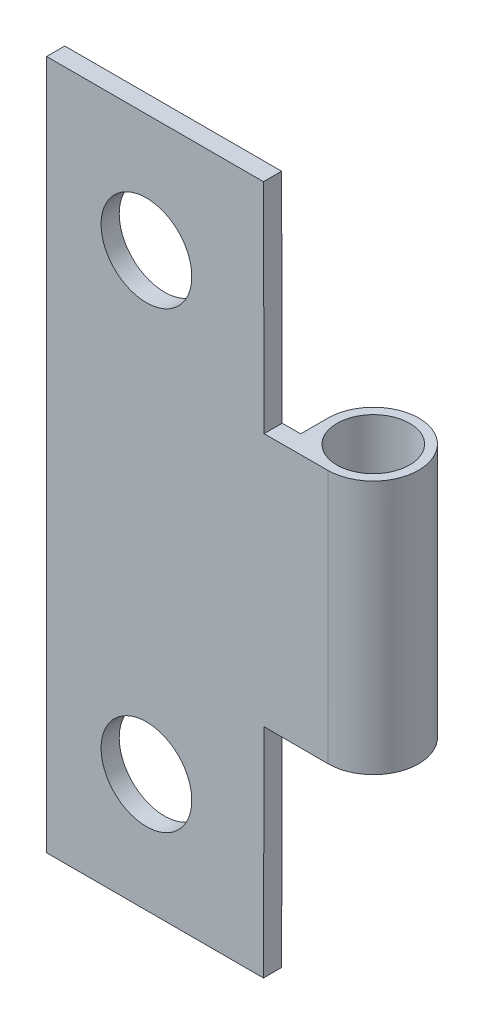
ISO-10303-21;
HEADER;
FILE_DESCRIPTION(('STEP AP214'),'2;1');
FILE_NAME('part.step','',(''),(''),'','','');
FILE_SCHEMA(('AUTOMOTIVE_DESIGN { 1 0 10303 214 1 1 1 1 }'));
ENDSEC;
DATA;
#1=APPLICATION_CONTEXT('core data for automotive mechanical design processes');
#2=APPLICATION_PROTOCOL_DEFINITION('international standard','automotive_design',2000,#1);
#3=PRODUCT_CONTEXT('',#1,'mechanical');
#4=PRODUCT('Part','Part','',(#3));
#5=PRODUCT_RELATED_PRODUCT_CATEGORY('part','',(#4));
#6=PRODUCT_DEFINITION_FORMATION('','',#4);
#7=PRODUCT_DEFINITION_CONTEXT('part definition',#1,'design');
#8=PRODUCT_DEFINITION('design','',#6,#7);
#9=PRODUCT_DEFINITION_SHAPE('','',#8);
#10=(LENGTH_UNIT() NAMED_UNIT(*) SI_UNIT(.MILLI.,.METRE.));
#11=(NAMED_UNIT(*) PLANE_ANGLE_UNIT() SI_UNIT($,.RADIAN.));
#12=(NAMED_UNIT(*) SI_UNIT($,.STERADIAN.) SOLID_ANGLE_UNIT());
#13=UNCERTAINTY_MEASURE_WITH_UNIT(LENGTH_MEASURE(1.E-05),#10,'distance_accuracy_value','');
#14=(GEOMETRIC_REPRESENTATION_CONTEXT(3) GLOBAL_UNCERTAINTY_ASSIGNED_CONTEXT((#13)) GLOBAL_UNIT_ASSIGNED_CONTEXT((#10,
#11,#12)) REPRESENTATION_CONTEXT('',''));
#15=CARTESIAN_POINT('',(0.,0.,0.));
#16=DIRECTION('',(0.,0.,1.));
#17=DIRECTION('',(1.,0.,0.));
#18=AXIS2_PLACEMENT_3D('',#15,#16,#17);
#19=CARTESIAN_POINT('',(-6.5,-19.,1.));
#20=DIRECTION('',(1.,0.,0.));
#21=DIRECTION('',(0.,1.,0.));
#22=AXIS2_PLACEMENT_3D('',#19,#20,#21);
#23=PLANE('',#22);
#24=DIRECTION('',(0.,-1.,0.));
#25=VECTOR('',#24,1.);
#26=CARTESIAN_POINT('',(-6.5,-19.,0.));
#27=LINE('',#26,#25);
#28=CARTESIAN_POINT('',(-6.50000000000001,19.,0.));
#29=VERTEX_POINT('',#28);
#30=CARTESIAN_POINT('',(-6.5,-19.,0.));
#31=VERTEX_POINT('',#30);
#32=EDGE_CURVE('E155',#29,#31,#27,.T.);
#33=ORIENTED_EDGE('',*,*,#32,.T.);
#34=DIRECTION('',(0.,0.,-1.));
#35=VECTOR('',#34,1.);
#36=CARTESIAN_POINT('',(-6.5,-19.,1.));
#37=LINE('',#36,#35);
#38=CARTESIAN_POINT('',(-6.5,-19.,1.));
#39=VERTEX_POINT('',#38);
#40=EDGE_CURVE('E174',#39,#31,#37,.T.);
#41=ORIENTED_EDGE('',*,*,#40,.F.);
#42=DIRECTION('',(0.,-1.,0.));
#43=VECTOR('',#42,1.);
#44=CARTESIAN_POINT('',(-6.5,-19.,1.));
#45=LINE('',#44,#43);
#46=CARTESIAN_POINT('',(-6.50000000000001,19.,1.));
#47=VERTEX_POINT('',#46);
#48=EDGE_CURVE('E157',#47,#39,#45,.T.);
#49=ORIENTED_EDGE('',*,*,#48,.F.);
#50=DIRECTION('',(0.,0.,-1.));
#51=VECTOR('',#50,1.);
#52=CARTESIAN_POINT('',(-6.50000000000001,19.,1.));
#53=LINE('',#52,#51);
#54=EDGE_CURVE('E163',#47,#29,#53,.T.);
#55=ORIENTED_EDGE('',*,*,#54,.T.);
#56=EDGE_LOOP('',(#33,#41,#49,#55));
#57=FACE_BOUND('',#56,.T.);
#58=ADVANCED_FACE('F32',(#57),#23,.F.);
#59=CARTESIAN_POINT('',(-6.5,-19.,1.));
#60=DIRECTION('',(0.,1.,0.));
#61=DIRECTION('',(0.,0.,1.));
#62=AXIS2_PLACEMENT_3D('',#59,#60,#61);
#63=PLANE('',#62);
#64=DIRECTION('',(1.,0.,0.));
#65=VECTOR('',#64,1.);
#66=CARTESIAN_POINT('',(-6.5,-19.,0.));
#67=LINE('',#66,#65);
#68=CARTESIAN_POINT('',(5.44826372232161,-19.,0.));
#69=VERTEX_POINT('',#68);
#70=EDGE_CURVE('E166',#31,#69,#67,.T.);
#71=ORIENTED_EDGE('',*,*,#70,.T.);
#72=DIRECTION('',(0.,0.,1.));
#73=VECTOR('',#72,1.);
#74=CARTESIAN_POINT('',(5.44826372232161,-19.,1.));
#75=LINE('',#74,#73);
#76=CARTESIAN_POINT('',(5.44826372232161,-19.,1.));
#77=VERTEX_POINT('',#76);
#78=EDGE_CURVE('E132',#69,#77,#75,.T.);
#79=ORIENTED_EDGE('',*,*,#78,.T.);
#80=DIRECTION('',(1.,0.,0.));
#81=VECTOR('',#80,1.);
#82=CARTESIAN_POINT('',(-6.5,-19.,1.));
#83=LINE('',#82,#81);
#84=EDGE_CURVE('E120',#39,#77,#83,.T.);
#85=ORIENTED_EDGE('',*,*,#84,.F.);
#86=ORIENTED_EDGE('',*,*,#40,.T.);
#87=EDGE_LOOP('',(#71,#79,#85,#86));
#88=FACE_BOUND('',#87,.T.);
#89=ADVANCED_FACE('F197',(#88),#63,.F.);
#90=CARTESIAN_POINT('',(-6.50000000000001,19.,1.));
#91=DIRECTION('',(0.,-1.,0.));
#92=DIRECTION('',(0.,0.,-1.));
#93=AXIS2_PLACEMENT_3D('',#90,#91,#92);
#94=PLANE('',#93);
#95=DIRECTION('',(-1.,0.,0.));
#96=VECTOR('',#95,1.);
#97=CARTESIAN_POINT('',(-6.50000000000001,19.,1.));
#98=LINE('',#97,#96);
#99=CARTESIAN_POINT('',(5.44826372232158,19.,1.));
#100=VERTEX_POINT('',#99);
#101=EDGE_CURVE('E161',#100,#47,#98,.T.);
#102=ORIENTED_EDGE('',*,*,#101,.F.);
#103=DIRECTION('',(0.,0.,-1.));
#104=VECTOR('',#103,1.);
#105=CARTESIAN_POINT('',(5.44826372232158,19.,1.));
#106=LINE('',#105,#104);
#107=CARTESIAN_POINT('',(5.44826372232158,19.,0.));
#108=VERTEX_POINT('',#107);
#109=EDGE_CURVE('E150',#100,#108,#106,.T.);
#110=ORIENTED_EDGE('',*,*,#109,.T.);
#111=DIRECTION('',(-1.,0.,0.));
#112=VECTOR('',#111,1.);
#113=CARTESIAN_POINT('',(-6.50000000000001,19.,0.));
#114=LINE('',#113,#112);
#115=EDGE_CURVE('E159',#108,#29,#114,.T.);
#116=ORIENTED_EDGE('',*,*,#115,.T.);
#117=ORIENTED_EDGE('',*,*,#54,.F.);
#118=EDGE_LOOP('',(#102,#110,#116,#117));
#119=FACE_BOUND('',#118,.T.);
#120=ADVANCED_FACE('F202',(#119),#94,.F.);
#121=CARTESIAN_POINT('',(0.,0.,1.));
#122=DIRECTION('',(0.,0.,-1.));
#123=DIRECTION('',(-1.,0.,0.));
#124=AXIS2_PLACEMENT_3D('',#121,#122,#123);
#125=PLANE('',#124);
#126=CARTESIAN_POINT('',(-1.00000000000001,-12.5,1.));
#127=DIRECTION('',(0.,0.,-1.));
#128=DIRECTION('',(-1.,0.,0.));
#129=AXIS2_PLACEMENT_3D('',#126,#127,#128);
#130=CIRCLE('',#129,2.5);
#131=CARTESIAN_POINT('',(-3.50000000000001,-12.5,1.));
#132=VERTEX_POINT('',#131);
#133=EDGE_CURVE('E322',#132,#132,#130,.T.);
#134=ORIENTED_EDGE('',*,*,#133,.T.);
#135=EDGE_LOOP('',(#134));
#136=FACE_BOUND('',#135,.T.);
#137=CARTESIAN_POINT('',(-1.,12.5,1.));
#138=DIRECTION('',(0.,0.,-1.));
#139=DIRECTION('',(-1.,0.,0.));
#140=AXIS2_PLACEMENT_3D('',#137,#138,#139);
#141=CIRCLE('',#140,2.5);
#142=CARTESIAN_POINT('',(-3.5,12.5,1.));
#143=VERTEX_POINT('',#142);
#144=EDGE_CURVE('E121',#143,#143,#141,.T.);
#145=ORIENTED_EDGE('',*,*,#144,.T.);
#146=EDGE_LOOP('',(#145));
#147=FACE_BOUND('',#146,.T.);
#148=ORIENTED_EDGE('',*,*,#84,.T.);
#149=DIRECTION('',(-0.00272226932309057,-0.999996294618001,0.));
#150=VECTOR('',#149,1.);
#151=CARTESIAN_POINT('',(5.48095708357535,-6.9904461196952,1.));
#152=LINE('',#151,#150);
#153=CARTESIAN_POINT('',(5.48095708357535,-6.9904461196952,1.));
#154=VERTEX_POINT('',#153);
#155=EDGE_CURVE('E106',#154,#77,#152,.T.);
#156=ORIENTED_EDGE('',*,*,#155,.F.);
#157=DIRECTION('',(-0.999996294618001,0.002722269323091,0.));
#158=VECTOR('',#157,1.);
#159=CARTESIAN_POINT('',(5.48095708357535,-6.9904461196952,1.));
#160=LINE('',#159,#158);
#161=CARTESIAN_POINT('',(9.,-7.00002593777011,1.));
#162=VERTEX_POINT('',#161);
#163=EDGE_CURVE('E111',#162,#154,#160,.T.);
#164=ORIENTED_EDGE('',*,*,#163,.F.);
#165=DIRECTION('',(0.,1.,0.));
#166=VECTOR('',#165,1.);
#167=CARTESIAN_POINT('',(9.,-19.,1.));
#168=LINE('',#167,#166);
#169=CARTESIAN_POINT('',(9.,7.00002593777009,1.));
#170=VERTEX_POINT('',#169);
#171=EDGE_CURVE('E54',#162,#170,#168,.T.);
#172=ORIENTED_EDGE('',*,*,#171,.T.);
#173=DIRECTION('',(0.999996294618001,0.00272226932309199,0.));
#174=VECTOR('',#173,1.);
#175=CARTESIAN_POINT('',(5.48095708357535,6.99044611969518,1.));
#176=LINE('',#175,#174);
#177=CARTESIAN_POINT('',(5.48095708357535,6.99044611969518,1.));
#178=VERTEX_POINT('',#177);
#179=EDGE_CURVE('E136',#178,#170,#176,.T.);
#180=ORIENTED_EDGE('',*,*,#179,.F.);
#181=DIRECTION('',(0.00272226932309168,-0.999996294618001,0.));
#182=VECTOR('',#181,1.);
#183=CARTESIAN_POINT('',(5.48095708357535,6.99044611969518,1.));
#184=LINE('',#183,#182);
#185=EDGE_CURVE('E134',#100,#178,#184,.T.);
#186=ORIENTED_EDGE('',*,*,#185,.F.);
#187=ORIENTED_EDGE('',*,*,#101,.T.);
#188=ORIENTED_EDGE('',*,*,#48,.T.);
#189=EDGE_LOOP('',(#148,#156,#164,#172,#180,#186,#187,#188));
#190=FACE_BOUND('',#189,.T.);
#191=ADVANCED_FACE('F118',(#136,#147,#190),#125,.F.);
#192=CARTESIAN_POINT('',(0.,0.,0.));
#193=DIRECTION('',(0.,0.,-1.));
#194=DIRECTION('',(-1.,0.,0.));
#195=AXIS2_PLACEMENT_3D('',#192,#193,#194);
#196=PLANE('',#195);
#197=CARTESIAN_POINT('',(-1.00000000000001,-12.5,0.));
#198=DIRECTION('',(0.,0.,-1.));
#199=DIRECTION('',(-1.,0.,0.));
#200=AXIS2_PLACEMENT_3D('',#197,#198,#199);
#201=CIRCLE('',#200,2.5);
#202=CARTESIAN_POINT('',(-3.50000000000001,-12.5,0.));
#203=VERTEX_POINT('',#202);
#204=EDGE_CURVE('E319',#203,#203,#201,.T.);
#205=ORIENTED_EDGE('',*,*,#204,.F.);
#206=EDGE_LOOP('',(#205));
#207=FACE_BOUND('',#206,.T.);
#208=CARTESIAN_POINT('',(-1.,12.5,0.));
#209=DIRECTION('',(0.,0.,-1.));
#210=DIRECTION('',(-1.,0.,0.));
#211=AXIS2_PLACEMENT_3D('',#208,#209,#210);
#212=CIRCLE('',#211,2.5);
#213=CARTESIAN_POINT('',(-3.5,12.5,0.));
#214=VERTEX_POINT('',#213);
#215=EDGE_CURVE('E124',#214,#214,#212,.T.);
#216=ORIENTED_EDGE('',*,*,#215,.F.);
#217=EDGE_LOOP('',(#216));
#218=FACE_BOUND('',#217,.T.);
#219=DIRECTION('',(0.00272226932309057,0.999996294618001,0.));
#220=VECTOR('',#219,1.);
#221=CARTESIAN_POINT('',(5.49994627208458,-0.0149723904935684,0.));
#222=LINE('',#221,#220);
#223=CARTESIAN_POINT('',(5.48095708357535,-6.9904461196952,0.));
#224=VERTEX_POINT('',#223);
#225=EDGE_CURVE('E11',#69,#224,#222,.T.);
#226=ORIENTED_EDGE('',*,*,#225,.F.);
#227=ORIENTED_EDGE('',*,*,#70,.F.);
#228=ORIENTED_EDGE('',*,*,#32,.F.);
#229=ORIENTED_EDGE('',*,*,#115,.F.);
#230=DIRECTION('',(-0.00272226932309168,0.999996294618001,0.));
#231=VECTOR('',#230,1.);
#232=CARTESIAN_POINT('',(5.49994627208458,0.0149723904935745,0.));
#233=LINE('',#232,#231);
#234=CARTESIAN_POINT('',(5.48095708357535,6.99044611969518,0.));
#235=VERTEX_POINT('',#234);
#236=EDGE_CURVE('E39',#235,#108,#233,.T.);
#237=ORIENTED_EDGE('',*,*,#236,.F.);
#238=DIRECTION('',(-0.999996294618001,-0.00272226932309199,0.));
#239=VECTOR('',#238,1.);
#240=CARTESIAN_POINT('',(-0.0189891885092369,6.97547372920161,0.));
#241=LINE('',#240,#239);
#242=CARTESIAN_POINT('',(6.5,6.99322023924465,0.));
#243=VERTEX_POINT('',#242);
#244=EDGE_CURVE('E148',#243,#235,#241,.T.);
#245=ORIENTED_EDGE('',*,*,#244,.F.);
#246=DIRECTION('',(0.,1.,0.));
#247=VECTOR('',#246,1.);
#248=CARTESIAN_POINT('',(6.50000000000001,-19.,0.));
#249=LINE('',#248,#247);
#250=CARTESIAN_POINT('',(6.5,-6.99322023924467,0.));
#251=VERTEX_POINT('',#250);
#252=EDGE_CURVE('E169',#251,#243,#249,.T.);
#253=ORIENTED_EDGE('',*,*,#252,.F.);
#254=DIRECTION('',(0.999996294618001,-0.002722269323091,0.));
#255=VECTOR('',#254,1.);
#256=CARTESIAN_POINT('',(-0.0189891885092301,-6.97547372920163,0.));
#257=LINE('',#256,#255);
#258=EDGE_CURVE('E130',#224,#251,#257,.T.);
#259=ORIENTED_EDGE('',*,*,#258,.F.);
#260=EDGE_LOOP('',(#226,#227,#228,#229,#237,#245,#253,#259));
#261=FACE_BOUND('',#260,.T.);
#262=ADVANCED_FACE('F210',(#207,#218,#261),#196,.T.);
#263=CARTESIAN_POINT('',(6.5,-19.,1.));
#264=DIRECTION('',(-1.,0.,0.));
#265=DIRECTION('',(0.,0.,1.));
#266=AXIS2_PLACEMENT_3D('',#263,#264,#265);
#267=PLANE('',#266);
#268=DIRECTION('',(0.,0.,-1.));
#269=VECTOR('',#268,1.);
#270=CARTESIAN_POINT('',(6.5,-6.99322023924467,1.));
#271=LINE('',#270,#269);
#272=CARTESIAN_POINT('',(6.5,-6.99322023924467,-1.5));
#273=VERTEX_POINT('',#272);
#274=EDGE_CURVE('E46',#251,#273,#271,.T.);
#275=ORIENTED_EDGE('',*,*,#274,.F.);
#276=ORIENTED_EDGE('',*,*,#252,.T.);
#277=DIRECTION('',(0.,0.,1.));
#278=VECTOR('',#277,1.);
#279=CARTESIAN_POINT('',(6.5,6.99322023924465,1.));
#280=LINE('',#279,#278);
#281=CARTESIAN_POINT('',(6.5,6.99322023924465,-1.5));
#282=VERTEX_POINT('',#281);
#283=EDGE_CURVE('E145',#282,#243,#280,.T.);
#284=ORIENTED_EDGE('',*,*,#283,.F.);
#285=DIRECTION('',(0.,1.,0.));
#286=VECTOR('',#285,1.);
#287=CARTESIAN_POINT('',(6.5,-19.,-1.5));
#288=LINE('',#287,#286);
#289=EDGE_CURVE('E153',#273,#282,#288,.T.);
#290=ORIENTED_EDGE('',*,*,#289,.F.);
#291=EDGE_LOOP('',(#275,#276,#284,#290));
#292=FACE_BOUND('',#291,.T.);
#293=ADVANCED_FACE('F226',(#292),#267,.T.);
#294=CARTESIAN_POINT('',(9.,-19.,-1.5));
#295=DIRECTION('',(0.,1.,0.));
#296=DIRECTION('',(0.,0.,1.));
#297=AXIS2_PLACEMENT_3D('',#294,#295,#296);
#298=CYLINDRICAL_SURFACE('',#297,2.5);
#299=CARTESIAN_POINT('',(9.,-7.00002593777011,-1.5));
#300=DIRECTION('',(0.002722269323091,0.999996294618001,0.));
#301=DIRECTION('',(-0.999996294618001,0.002722269323091,0.));
#302=AXIS2_PLACEMENT_3D('',#299,#300,#301);
#303=ELLIPSE('',#302,2.50000926348932,2.5);
#304=EDGE_CURVE('E115',#273,#162,#303,.F.);
#305=ORIENTED_EDGE('',*,*,#304,.F.);
#306=ORIENTED_EDGE('',*,*,#289,.T.);
#307=CARTESIAN_POINT('',(9.,7.00002593777009,-1.5));
#308=DIRECTION('',(0.00272226932309199,-0.999996294618001,0.));
#309=DIRECTION('',(0.999996294618001,0.00272226932309199,0.));
#310=AXIS2_PLACEMENT_3D('',#307,#308,#309);
#311=ELLIPSE('',#310,2.50000926348932,2.5);
#312=EDGE_CURVE('E142',#170,#282,#311,.F.);
#313=ORIENTED_EDGE('',*,*,#312,.F.);
#314=ORIENTED_EDGE('',*,*,#171,.F.);
#315=EDGE_LOOP('',(#305,#306,#313,#314));
#316=FACE_BOUND('',#315,.T.);
#317=ADVANCED_FACE('F228',(#316),#298,.T.);
#318=CARTESIAN_POINT('',(9.,-19.,-1.5));
#319=DIRECTION('',(0.,1.,0.));
#320=DIRECTION('',(0.,0.,1.));
#321=AXIS2_PLACEMENT_3D('',#318,#319,#320);
#322=CYLINDRICAL_SURFACE('',#321,2.);
#323=CARTESIAN_POINT('',(9.,-7.00002593777011,-1.5));
#324=DIRECTION('',(0.002722269323091,0.999996294618001,0.));
#325=DIRECTION('',(-0.999996294618001,0.002722269323091,0.));
#326=AXIS2_PLACEMENT_3D('',#323,#324,#325);
#327=ELLIPSE('',#326,2.00000741079146,2.);
#328=CARTESIAN_POINT('',(7.,-6.99458137894976,-1.5));
#329=VERTEX_POINT('',#328);
#330=EDGE_CURVE('E110',#329,#329,#327,.F.);
#331=ORIENTED_EDGE('',*,*,#330,.T.);
#332=EDGE_LOOP('',(#331));
#333=FACE_BOUND('',#332,.T.);
#334=CARTESIAN_POINT('',(9.,7.00002593777009,-1.5));
#335=DIRECTION('',(0.00272226932309199,-0.999996294618001,0.));
#336=DIRECTION('',(0.999996294618001,0.00272226932309199,0.));
#337=AXIS2_PLACEMENT_3D('',#334,#335,#336);
#338=ELLIPSE('',#337,2.00000741079146,2.);
#339=CARTESIAN_POINT('',(11.,7.00547049659045,-1.5));
#340=VERTEX_POINT('',#339);
#341=EDGE_CURVE('E141',#340,#340,#338,.F.);
#342=ORIENTED_EDGE('',*,*,#341,.T.);
#343=EDGE_LOOP('',(#342));
#344=FACE_BOUND('',#343,.T.);
#345=ADVANCED_FACE('F182',(#333,#344),#322,.F.);
#346=CARTESIAN_POINT('',(5.48095708357535,6.99044611969518,-9.));
#347=DIRECTION('',(-0.999996294618001,-0.00272226932309168,0.));
#348=DIRECTION('',(0.00272226932309168,-0.999996294618001,0.));
#349=AXIS2_PLACEMENT_3D('',#346,#347,#348);
#350=PLANE('',#349);
#351=ORIENTED_EDGE('',*,*,#185,.T.);
#352=DIRECTION('',(0.,0.,1.));
#353=VECTOR('',#352,1.);
#354=CARTESIAN_POINT('',(5.48095708357535,6.99044611969518,-9.));
#355=LINE('',#354,#353);
#356=EDGE_CURVE('E138',#235,#178,#355,.T.);
#357=ORIENTED_EDGE('',*,*,#356,.F.);
#358=ORIENTED_EDGE('',*,*,#236,.T.);
#359=ORIENTED_EDGE('',*,*,#109,.F.);
#360=EDGE_LOOP('',(#351,#357,#358,#359));
#361=FACE_BOUND('',#360,.T.);
#362=ADVANCED_FACE('F216',(#361),#350,.F.);
#363=CARTESIAN_POINT('',(5.48095708357535,6.99044611969518,-9.));
#364=DIRECTION('',(0.00272226932309199,-0.999996294618001,0.));
#365=DIRECTION('',(0.999996294618001,0.00272226932309199,0.));
#366=AXIS2_PLACEMENT_3D('',#363,#364,#365);
#367=PLANE('',#366);
#368=ORIENTED_EDGE('',*,*,#244,.T.);
#369=ORIENTED_EDGE('',*,*,#356,.T.);
#370=ORIENTED_EDGE('',*,*,#179,.T.);
#371=ORIENTED_EDGE('',*,*,#312,.T.);
#372=ORIENTED_EDGE('',*,*,#283,.T.);
#373=EDGE_LOOP('',(#368,#369,#370,#371,#372));
#374=FACE_BOUND('',#373,.T.);
#375=ORIENTED_EDGE('',*,*,#341,.F.);
#376=EDGE_LOOP('',(#375));
#377=FACE_BOUND('',#376,.T.);
#378=ADVANCED_FACE('F194',(#374,#377),#367,.F.);
#379=CARTESIAN_POINT('',(5.48095708357535,-6.9904461196952,-9.));
#380=DIRECTION('',(-0.999996294618001,0.00272226932309057,0.));
#381=DIRECTION('',(-0.00272226932309057,-0.999996294618001,0.));
#382=AXIS2_PLACEMENT_3D('',#379,#380,#381);
#383=PLANE('',#382);
#384=ORIENTED_EDGE('',*,*,#225,.T.);
#385=DIRECTION('',(0.,0.,1.));
#386=VECTOR('',#385,1.);
#387=CARTESIAN_POINT('',(5.48095708357535,-6.9904461196952,-9.));
#388=LINE('',#387,#386);
#389=EDGE_CURVE('E102',#224,#154,#388,.T.);
#390=ORIENTED_EDGE('',*,*,#389,.T.);
#391=ORIENTED_EDGE('',*,*,#155,.T.);
#392=ORIENTED_EDGE('',*,*,#78,.F.);
#393=EDGE_LOOP('',(#384,#390,#391,#392));
#394=FACE_BOUND('',#393,.T.);
#395=ADVANCED_FACE('F104',(#394),#383,.F.);
#396=CARTESIAN_POINT('',(5.48095708357535,-6.9904461196952,-9.));
#397=DIRECTION('',(0.002722269323091,0.999996294618001,0.));
#398=DIRECTION('',(-0.999996294618001,0.002722269323091,0.));
#399=AXIS2_PLACEMENT_3D('',#396,#397,#398);
#400=PLANE('',#399);
#401=ORIENTED_EDGE('',*,*,#258,.T.);
#402=ORIENTED_EDGE('',*,*,#274,.T.);
#403=ORIENTED_EDGE('',*,*,#304,.T.);
#404=ORIENTED_EDGE('',*,*,#163,.T.);
#405=ORIENTED_EDGE('',*,*,#389,.F.);
#406=EDGE_LOOP('',(#401,#402,#403,#404,#405));
#407=FACE_BOUND('',#406,.T.);
#408=ORIENTED_EDGE('',*,*,#330,.F.);
#409=EDGE_LOOP('',(#408));
#410=FACE_BOUND('',#409,.T.);
#411=ADVANCED_FACE('F113',(#407,#410),#400,.F.);
#412=CARTESIAN_POINT('',(-1.,12.5,2.));
#413=DIRECTION('',(0.,0.,-1.));
#414=DIRECTION('',(-1.,0.,0.));
#415=AXIS2_PLACEMENT_3D('',#412,#413,#414);
#416=CYLINDRICAL_SURFACE('',#415,2.5);
#417=ORIENTED_EDGE('',*,*,#215,.T.);
#418=EDGE_LOOP('',(#417));
#419=FACE_BOUND('',#418,.T.);
#420=ORIENTED_EDGE('',*,*,#144,.F.);
#421=EDGE_LOOP('',(#420));
#422=FACE_BOUND('',#421,.T.);
#423=ADVANCED_FACE('F185',(#419,#422),#416,.F.);
#424=CARTESIAN_POINT('',(-1.00000000000001,-12.5,2.));
#425=DIRECTION('',(0.,0.,-1.));
#426=DIRECTION('',(-1.,0.,0.));
#427=AXIS2_PLACEMENT_3D('',#424,#425,#426);
#428=CYLINDRICAL_SURFACE('',#427,2.5);
#429=ORIENTED_EDGE('',*,*,#204,.T.);
#430=EDGE_LOOP('',(#429));
#431=FACE_BOUND('',#430,.T.);
#432=ORIENTED_EDGE('',*,*,#133,.F.);
#433=EDGE_LOOP('',(#432));
#434=FACE_BOUND('',#433,.T.);
#435=ADVANCED_FACE('F191',(#431,#434),#428,.F.);
#436=CLOSED_SHELL('',(#58,#89,#120,#191,#262,#293,#317,#345,#362,#378,#395,#411,#423,#435));
#437=MANIFOLD_SOLID_BREP('B2',#436);
#438=ADVANCED_BREP_SHAPE_REPRESENTATION('',(#18,#437),#14);
#439=SHAPE_DEFINITION_REPRESENTATION(#9,#438);
ENDSEC;
END-ISO-10303-21;
